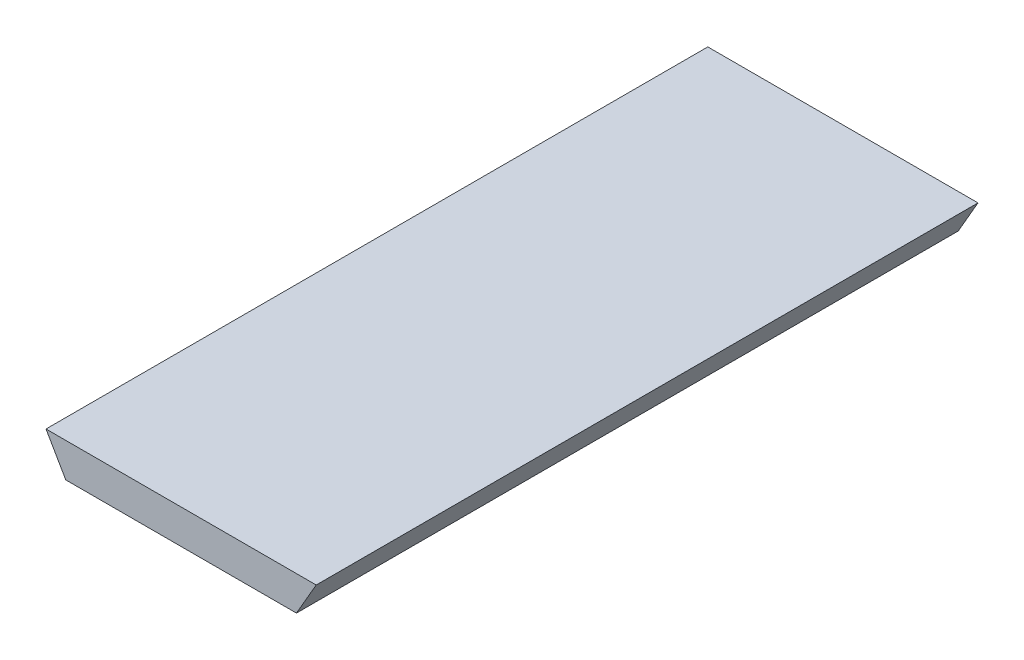
ISO-10303-21;
HEADER;
FILE_DESCRIPTION(('STEP AP214'),'2;1');
FILE_NAME('part.step','',(''),(''),'','','');
FILE_SCHEMA(('AUTOMOTIVE_DESIGN { 1 0 10303 214 1 1 1 1 }'));
ENDSEC;
DATA;
#1=APPLICATION_CONTEXT('core data for automotive mechanical design processes');
#2=APPLICATION_PROTOCOL_DEFINITION('international standard','automotive_design',2000,#1);
#3=PRODUCT_CONTEXT('',#1,'mechanical');
#4=PRODUCT('Part','Part','',(#3));
#5=PRODUCT_RELATED_PRODUCT_CATEGORY('part','',(#4));
#6=PRODUCT_DEFINITION_FORMATION('','',#4);
#7=PRODUCT_DEFINITION_CONTEXT('part definition',#1,'design');
#8=PRODUCT_DEFINITION('design','',#6,#7);
#9=PRODUCT_DEFINITION_SHAPE('','',#8);
#10=(LENGTH_UNIT() NAMED_UNIT(*) SI_UNIT(.MILLI.,.METRE.));
#11=(NAMED_UNIT(*) PLANE_ANGLE_UNIT() SI_UNIT($,.RADIAN.));
#12=(NAMED_UNIT(*) SI_UNIT($,.STERADIAN.) SOLID_ANGLE_UNIT());
#13=UNCERTAINTY_MEASURE_WITH_UNIT(LENGTH_MEASURE(1.E-05),#10,'distance_accuracy_value','');
#14=(GEOMETRIC_REPRESENTATION_CONTEXT(3) GLOBAL_UNCERTAINTY_ASSIGNED_CONTEXT((#13)) GLOBAL_UNIT_ASSIGNED_CONTEXT((#10,
#11,#12)) REPRESENTATION_CONTEXT('',''));
#15=CARTESIAN_POINT('',(0.,0.,0.));
#16=DIRECTION('',(0.,0.,1.));
#17=DIRECTION('',(1.,0.,0.));
#18=AXIS2_PLACEMENT_3D('',#15,#16,#17);
#19=CARTESIAN_POINT('',(0.,30.,580.));
#20=DIRECTION('',(0.,1.,0.));
#21=DIRECTION('',(-1.,0.,0.));
#22=AXIS2_PLACEMENT_3D('',#19,#20,#21);
#23=PLANE('',#22);
#24=DIRECTION('',(1.,0.,0.));
#25=VECTOR('',#24,1.);
#26=CARTESIAN_POINT('',(0.,30.,0.));
#27=LINE('',#26,#25);
#28=CARTESIAN_POINT('',(0.,30.,0.));
#29=VERTEX_POINT('',#28);
#30=CARTESIAN_POINT('',(236.807621582497,30.,0.));
#31=VERTEX_POINT('',#30);
#32=EDGE_CURVE('E100',#29,#31,#27,.T.);
#33=ORIENTED_EDGE('',*,*,#32,.F.);
#34=DIRECTION('',(0.,0.,-1.));
#35=VECTOR('',#34,1.);
#36=CARTESIAN_POINT('',(0.,30.,580.));
#37=LINE('',#36,#35);
#38=CARTESIAN_POINT('',(0.,30.,580.));
#39=VERTEX_POINT('',#38);
#40=EDGE_CURVE('E11',#39,#29,#37,.T.);
#41=ORIENTED_EDGE('',*,*,#40,.F.);
#42=DIRECTION('',(1.,0.,0.));
#43=VECTOR('',#42,1.);
#44=CARTESIAN_POINT('',(0.,30.,580.));
#45=LINE('',#44,#43);
#46=CARTESIAN_POINT('',(236.807621582497,30.,580.));
#47=VERTEX_POINT('',#46);
#48=EDGE_CURVE('E85',#39,#47,#45,.T.);
#49=ORIENTED_EDGE('',*,*,#48,.T.);
#50=DIRECTION('',(0.,0.,-1.));
#51=VECTOR('',#50,1.);
#52=CARTESIAN_POINT('',(236.807621582497,30.,580.));
#53=LINE('',#52,#51);
#54=EDGE_CURVE('E53',#47,#31,#53,.T.);
#55=ORIENTED_EDGE('',*,*,#54,.T.);
#56=EDGE_LOOP('',(#33,#41,#49,#55));
#57=FACE_BOUND('',#56,.T.);
#58=ADVANCED_FACE('F37',(#57),#23,.T.);
#59=CARTESIAN_POINT('',(12.9896188202629,7.49867992255546,580.));
#60=DIRECTION('',(0.866050808314088,0.499955995482117,0.));
#61=DIRECTION('',(-0.499955995482117,0.866050808314088,0.));
#62=AXIS2_PLACEMENT_3D('',#59,#60,#61);
#63=PLANE('',#62);
#64=DIRECTION('',(0.499955995482118,-0.866050808314088,0.));
#65=VECTOR('',#64,1.);
#66=CARTESIAN_POINT('',(12.9896188202629,7.49867992255546,0.));
#67=LINE('',#66,#65);
#68=CARTESIAN_POINT('',(17.3184756835006,0.,0.));
#69=VERTEX_POINT('',#68);
#70=EDGE_CURVE('E91',#29,#69,#67,.T.);
#71=ORIENTED_EDGE('',*,*,#70,.T.);
#72=DIRECTION('',(0.,0.,-1.));
#73=VECTOR('',#72,1.);
#74=CARTESIAN_POINT('',(17.3184756835006,0.,580.));
#75=LINE('',#74,#73);
#76=CARTESIAN_POINT('',(17.3184756835006,0.,580.));
#77=VERTEX_POINT('',#76);
#78=EDGE_CURVE('E45',#77,#69,#75,.T.);
#79=ORIENTED_EDGE('',*,*,#78,.F.);
#80=DIRECTION('',(0.499955995482118,-0.866050808314088,0.));
#81=VECTOR('',#80,1.);
#82=CARTESIAN_POINT('',(12.9896188202629,7.49867992255546,580.));
#83=LINE('',#82,#81);
#84=EDGE_CURVE('E79',#39,#77,#83,.T.);
#85=ORIENTED_EDGE('',*,*,#84,.F.);
#86=ORIENTED_EDGE('',*,*,#40,.T.);
#87=EDGE_LOOP('',(#71,#79,#85,#86));
#88=FACE_BOUND('',#87,.T.);
#89=ADVANCED_FACE('F89',(#88),#63,.F.);
#90=CARTESIAN_POINT('',(0.,0.,580.));
#91=DIRECTION('',(0.,1.,0.));
#92=DIRECTION('',(-1.,0.,0.));
#93=AXIS2_PLACEMENT_3D('',#90,#91,#92);
#94=PLANE('',#93);
#95=DIRECTION('',(1.,0.,0.));
#96=VECTOR('',#95,1.);
#97=CARTESIAN_POINT('',(0.,0.,0.));
#98=LINE('',#97,#96);
#99=CARTESIAN_POINT('',(219.489145898997,0.,0.));
#100=VERTEX_POINT('',#99);
#101=EDGE_CURVE('E103',#69,#100,#98,.T.);
#102=ORIENTED_EDGE('',*,*,#101,.T.);
#103=DIRECTION('',(0.,0.,-1.));
#104=VECTOR('',#103,1.);
#105=CARTESIAN_POINT('',(219.489145898997,0.,580.));
#106=LINE('',#105,#104);
#107=CARTESIAN_POINT('',(219.489145898997,0.,580.));
#108=VERTEX_POINT('',#107);
#109=EDGE_CURVE('E67',#108,#100,#106,.T.);
#110=ORIENTED_EDGE('',*,*,#109,.F.);
#111=DIRECTION('',(1.,0.,0.));
#112=VECTOR('',#111,1.);
#113=CARTESIAN_POINT('',(0.,0.,580.));
#114=LINE('',#113,#112);
#115=EDGE_CURVE('E84',#77,#108,#114,.T.);
#116=ORIENTED_EDGE('',*,*,#115,.F.);
#117=ORIENTED_EDGE('',*,*,#78,.T.);
#118=EDGE_LOOP('',(#102,#110,#116,#117));
#119=FACE_BOUND('',#118,.T.);
#120=ADVANCED_FACE('F94',(#119),#94,.F.);
#121=CARTESIAN_POINT('',(164.626517513275,-95.036011347101,580.));
#122=DIRECTION('',(0.866050808314088,-0.499955995482118,0.));
#123=DIRECTION('',(0.499955995482118,0.866050808314088,0.));
#124=AXIS2_PLACEMENT_3D('',#121,#122,#123);
#125=PLANE('',#124);
#126=DIRECTION('',(-0.499955995482118,-0.866050808314088,0.));
#127=VECTOR('',#126,1.);
#128=CARTESIAN_POINT('',(164.626517513275,-95.036011347101,0.));
#129=LINE('',#128,#127);
#130=EDGE_CURVE('E105',#31,#100,#129,.T.);
#131=ORIENTED_EDGE('',*,*,#130,.F.);
#132=ORIENTED_EDGE('',*,*,#54,.F.);
#133=DIRECTION('',(-0.499955995482118,-0.866050808314088,0.));
#134=VECTOR('',#133,1.);
#135=CARTESIAN_POINT('',(164.626517513275,-95.036011347101,580.));
#136=LINE('',#135,#134);
#137=EDGE_CURVE('E95',#47,#108,#136,.T.);
#138=ORIENTED_EDGE('',*,*,#137,.T.);
#139=ORIENTED_EDGE('',*,*,#109,.T.);
#140=EDGE_LOOP('',(#131,#132,#138,#139));
#141=FACE_BOUND('',#140,.T.);
#142=ADVANCED_FACE('F110',(#141),#125,.T.);
#143=CARTESIAN_POINT('',(0.,0.,580.));
#144=DIRECTION('',(0.,0.,1.));
#145=DIRECTION('',(1.,0.,0.));
#146=AXIS2_PLACEMENT_3D('',#143,#144,#145);
#147=PLANE('',#146);
#148=ORIENTED_EDGE('',*,*,#48,.F.);
#149=ORIENTED_EDGE('',*,*,#84,.T.);
#150=ORIENTED_EDGE('',*,*,#115,.T.);
#151=ORIENTED_EDGE('',*,*,#137,.F.);
#152=EDGE_LOOP('',(#148,#149,#150,#151));
#153=FACE_BOUND('',#152,.T.);
#154=ADVANCED_FACE('F81',(#153),#147,.T.);
#155=CARTESIAN_POINT('',(0.,0.,0.));
#156=DIRECTION('',(0.,0.,1.));
#157=DIRECTION('',(1.,0.,0.));
#158=AXIS2_PLACEMENT_3D('',#155,#156,#157);
#159=PLANE('',#158);
#160=ORIENTED_EDGE('',*,*,#32,.T.);
#161=ORIENTED_EDGE('',*,*,#130,.T.);
#162=ORIENTED_EDGE('',*,*,#101,.F.);
#163=ORIENTED_EDGE('',*,*,#70,.F.);
#164=EDGE_LOOP('',(#160,#161,#162,#163));
#165=FACE_BOUND('',#164,.T.);
#166=ADVANCED_FACE('F117',(#165),#159,.F.);
#167=CLOSED_SHELL('',(#58,#89,#120,#142,#154,#166));
#168=MANIFOLD_SOLID_BREP('B2',#167);
#169=ADVANCED_BREP_SHAPE_REPRESENTATION('',(#18,#168),#14);
#170=SHAPE_DEFINITION_REPRESENTATION(#9,#169);
ENDSEC;
END-ISO-10303-21;
